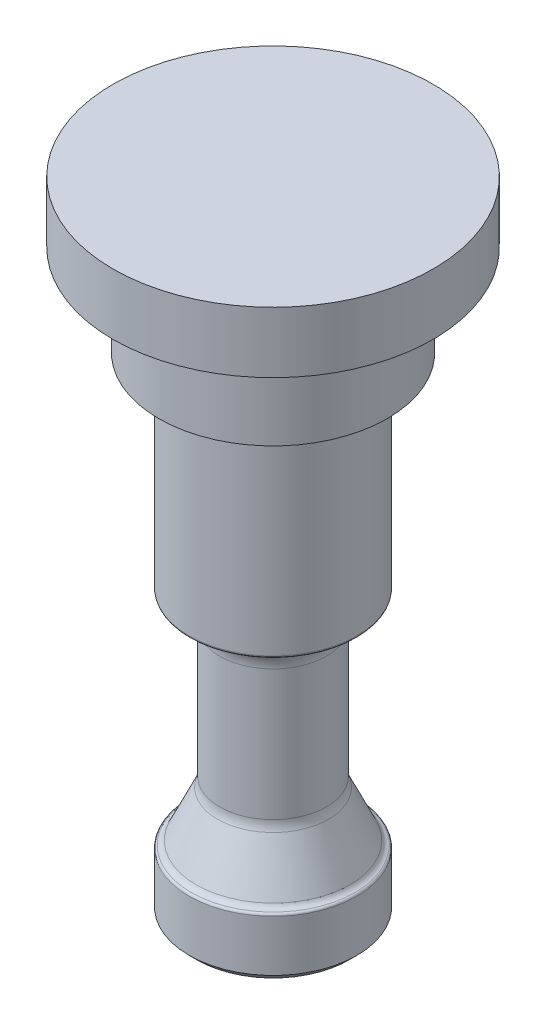
ISO-10303-21;
HEADER;
FILE_DESCRIPTION(('STEP AP214'),'2;1');
FILE_NAME('part.step','',(''),(''),'','','');
FILE_SCHEMA(('AUTOMOTIVE_DESIGN { 1 0 10303 214 1 1 1 1 }'));
ENDSEC;
DATA;
#1=APPLICATION_CONTEXT('core data for automotive mechanical design processes');
#2=APPLICATION_PROTOCOL_DEFINITION('international standard','automotive_design',2000,#1);
#3=PRODUCT_CONTEXT('',#1,'mechanical');
#4=PRODUCT('Part','Part','',(#3));
#5=PRODUCT_RELATED_PRODUCT_CATEGORY('part','',(#4));
#6=PRODUCT_DEFINITION_FORMATION('','',#4);
#7=PRODUCT_DEFINITION_CONTEXT('part definition',#1,'design');
#8=PRODUCT_DEFINITION('design','',#6,#7);
#9=PRODUCT_DEFINITION_SHAPE('','',#8);
#10=(LENGTH_UNIT() NAMED_UNIT(*) SI_UNIT(.MILLI.,.METRE.));
#11=(NAMED_UNIT(*) PLANE_ANGLE_UNIT() SI_UNIT($,.RADIAN.));
#12=(NAMED_UNIT(*) SI_UNIT($,.STERADIAN.) SOLID_ANGLE_UNIT());
#13=UNCERTAINTY_MEASURE_WITH_UNIT(LENGTH_MEASURE(1.E-05),#10,'distance_accuracy_value','');
#14=(GEOMETRIC_REPRESENTATION_CONTEXT(3) GLOBAL_UNCERTAINTY_ASSIGNED_CONTEXT((#13)) GLOBAL_UNIT_ASSIGNED_CONTEXT((#10,
#11,#12)) REPRESENTATION_CONTEXT('',''));
#15=CARTESIAN_POINT('',(0.,0.,0.));
#16=DIRECTION('',(0.,0.,1.));
#17=DIRECTION('',(1.,0.,0.));
#18=AXIS2_PLACEMENT_3D('',#15,#16,#17);
#19=CARTESIAN_POINT('',(0.,50.8,0.));
#20=DIRECTION('',(0.,-1.,0.));
#21=DIRECTION('',(0.,0.,-1.));
#22=AXIS2_PLACEMENT_3D('',#19,#20,#21);
#23=CYLINDRICAL_SURFACE('',#22,8.73125);
#24=CARTESIAN_POINT('',(0.,6.12725402730753,0.));
#25=DIRECTION('',(0.,-1.,0.));
#26=DIRECTION('',(0.,0.,-1.));
#27=AXIS2_PLACEMENT_3D('',#24,#25,#26);
#28=CIRCLE('',#27,8.73125);
#29=CARTESIAN_POINT('',(0.,6.12725402730753,-8.73125));
#30=VERTEX_POINT('',#29);
#31=EDGE_CURVE('E46',#30,#30,#28,.T.);
#32=ORIENTED_EDGE('',*,*,#31,.T.);
#33=EDGE_LOOP('',(#32));
#34=FACE_BOUND('',#33,.T.);
#35=CARTESIAN_POINT('',(0.,0.79375000000001,0.));
#36=DIRECTION('',(0.,1.,0.));
#37=DIRECTION('',(0.,0.,1.));
#38=AXIS2_PLACEMENT_3D('',#35,#36,#37);
#39=CIRCLE('',#38,8.73125);
#40=CARTESIAN_POINT('',(0.,0.79375000000001,8.73125));
#41=VERTEX_POINT('',#40);
#42=EDGE_CURVE('E70',#41,#41,#39,.T.);
#43=ORIENTED_EDGE('',*,*,#42,.T.);
#44=EDGE_LOOP('',(#43));
#45=FACE_BOUND('',#44,.T.);
#46=ADVANCED_FACE('F35',(#34,#45),#23,.T.);
#47=CARTESIAN_POINT('',(0.,0.,0.));
#48=DIRECTION('',(0.,1.,0.));
#49=DIRECTION('',(0.,0.,1.));
#50=AXIS2_PLACEMENT_3D('',#47,#48,#49);
#51=PLANE('',#50);
#52=CARTESIAN_POINT('',(0.,0.,0.));
#53=DIRECTION('',(0.,-1.,0.));
#54=DIRECTION('',(0.,0.,-1.));
#55=AXIS2_PLACEMENT_3D('',#52,#53,#54);
#56=CIRCLE('',#55,2.38125);
#57=CARTESIAN_POINT('',(0.,0.,-2.38125));
#58=VERTEX_POINT('',#57);
#59=EDGE_CURVE('E95',#58,#58,#56,.T.);
#60=ORIENTED_EDGE('',*,*,#59,.F.);
#61=EDGE_LOOP('',(#60));
#62=FACE_BOUND('',#61,.T.);
#63=CARTESIAN_POINT('',(0.,0.,0.));
#64=DIRECTION('',(0.,1.,0.));
#65=DIRECTION('',(0.,0.,1.));
#66=AXIS2_PLACEMENT_3D('',#63,#64,#65);
#67=CIRCLE('',#66,7.93749999999999);
#68=CARTESIAN_POINT('',(0.,0.,7.93749999999999));
#69=VERTEX_POINT('',#68);
#70=EDGE_CURVE('E67',#69,#69,#67,.F.);
#71=ORIENTED_EDGE('',*,*,#70,.T.);
#72=EDGE_LOOP('',(#71));
#73=FACE_BOUND('',#72,.T.);
#74=ADVANCED_FACE('F109',(#62,#73),#51,.F.);
#75=CARTESIAN_POINT('',(0.,0.79375000000001,0.));
#76=DIRECTION('',(0.,1.,0.));
#77=DIRECTION('',(0.,0.,1.));
#78=AXIS2_PLACEMENT_3D('',#75,#76,#77);
#79=CONICAL_SURFACE('',#78,8.73125,0.785398163397446);
#80=ORIENTED_EDGE('',*,*,#70,.F.);
#81=EDGE_LOOP('',(#80));
#82=FACE_BOUND('',#81,.T.);
#83=ORIENTED_EDGE('',*,*,#42,.F.);
#84=EDGE_LOOP('',(#83));
#85=FACE_BOUND('',#84,.T.);
#86=ADVANCED_FACE('F112',(#82,#85),#79,.T.);
#87=CARTESIAN_POINT('',(0.,12.602297381409,0.));
#88=DIRECTION('',(0.,1.,0.));
#89=DIRECTION('',(0.,0.,1.));
#90=AXIS2_PLACEMENT_3D('',#87,#88,#89);
#91=TOROIDAL_SURFACE('',#90,7.93749999999999,2.38125);
#92=CARTESIAN_POINT('',(0.,11.595937645639,0.));
#93=DIRECTION('',(0.,1.,0.));
#94=DIRECTION('',(0.,0.,1.));
#95=AXIS2_PLACEMENT_3D('',#92,#93,#94);
#96=CIRCLE('',#95,5.77935458211897);
#97=CARTESIAN_POINT('',(0.,11.595937645639,5.77935458211897));
#98=VERTEX_POINT('',#97);
#99=EDGE_CURVE('E73',#98,#98,#96,.T.);
#100=ORIENTED_EDGE('',*,*,#99,.T.);
#101=EDGE_LOOP('',(#100));
#102=FACE_BOUND('',#101,.T.);
#103=CARTESIAN_POINT('',(0.,12.602297381409,0.));
#104=DIRECTION('',(0.,1.,0.));
#105=DIRECTION('',(0.,0.,1.));
#106=AXIS2_PLACEMENT_3D('',#103,#104,#105);
#107=CIRCLE('',#106,5.55624999999999);
#108=CARTESIAN_POINT('',(0.,12.602297381409,5.55624999999999));
#109=VERTEX_POINT('',#108);
#110=EDGE_CURVE('E82',#109,#109,#107,.T.);
#111=ORIENTED_EDGE('',*,*,#110,.F.);
#112=EDGE_LOOP('',(#111));
#113=FACE_BOUND('',#112,.T.);
#114=ADVANCED_FACE('F118',(#102,#113),#91,.F.);
#115=CARTESIAN_POINT('',(0.,11.595937645639,0.));
#116=DIRECTION('',(0.,-1.,0.));
#117=DIRECTION('',(0.,0.,-1.));
#118=AXIS2_PLACEMENT_3D('',#115,#116,#117);
#119=CONICAL_SURFACE('',#118,5.77935458211897,0.436332312998583);
#120=CARTESIAN_POINT('',(0.,6.80829675474332,0.));
#121=DIRECTION('',(0.,1.,0.));
#122=DIRECTION('',(0.,0.,1.));
#123=AXIS2_PLACEMENT_3D('',#120,#121,#122);
#124=CIRCLE('',#123,8.01186819403965);
#125=CARTESIAN_POINT('',(0.,6.80829675474332,8.01186819403965));
#126=VERTEX_POINT('',#125);
#127=EDGE_CURVE('E76',#126,#126,#124,.T.);
#128=ORIENTED_EDGE('',*,*,#127,.T.);
#129=EDGE_LOOP('',(#128));
#130=FACE_BOUND('',#129,.T.);
#131=ORIENTED_EDGE('',*,*,#99,.F.);
#132=EDGE_LOOP('',(#131));
#133=FACE_BOUND('',#132,.T.);
#134=ADVANCED_FACE('F174',(#130,#133),#119,.T.);
#135=CARTESIAN_POINT('',(0.,7.14375,0.));
#136=DIRECTION('',(0.,1.,0.));
#137=DIRECTION('',(0.,0.,1.));
#138=AXIS2_PLACEMENT_3D('',#135,#136,#137);
#139=TOROIDAL_SURFACE('',#138,8.73124999999999,0.793750000000001);
#140=CARTESIAN_POINT('',(0.,6.37367729341487,0.));
#141=DIRECTION('',(0.,1.,0.));
#142=DIRECTION('',(0.,0.,1.));
#143=AXIS2_PLACEMENT_3D('',#140,#141,#142);
#144=CIRCLE('',#143,8.53882575757577);
#145=CARTESIAN_POINT('',(0.,6.37367729341487,8.53882575757577));
#146=VERTEX_POINT('',#145);
#147=EDGE_CURVE('E50',#146,#146,#144,.T.);
#148=ORIENTED_EDGE('',*,*,#147,.T.);
#149=EDGE_LOOP('',(#148));
#150=FACE_BOUND('',#149,.T.);
#151=ORIENTED_EDGE('',*,*,#127,.F.);
#152=EDGE_LOOP('',(#151));
#153=FACE_BOUND('',#152,.T.);
#154=ADVANCED_FACE('F170',(#150,#153),#139,.F.);
#155=CARTESIAN_POINT('',(0.,26.19375,0.));
#156=DIRECTION('',(0.,1.,0.));
#157=DIRECTION('',(0.,0.,1.));
#158=AXIS2_PLACEMENT_3D('',#155,#156,#157);
#159=TOROIDAL_SURFACE('',#158,8.73125,3.175);
#160=CARTESIAN_POINT('',(0.,29.3600274560473,0.));
#161=DIRECTION('',(0.,-1.,0.));
#162=DIRECTION('',(0.,0.,-1.));
#163=AXIS2_PLACEMENT_3D('',#160,#161,#162);
#164=CIRCLE('',#163,8.49606481481477);
#165=CARTESIAN_POINT('',(0.,29.3600274560473,-8.49606481481477));
#166=VERTEX_POINT('',#165);
#167=EDGE_CURVE('E58',#166,#166,#164,.T.);
#168=ORIENTED_EDGE('',*,*,#167,.T.);
#169=EDGE_LOOP('',(#168));
#170=FACE_BOUND('',#169,.T.);
#171=CARTESIAN_POINT('',(0.,26.19375,0.));
#172=DIRECTION('',(0.,1.,0.));
#173=DIRECTION('',(0.,0.,1.));
#174=AXIS2_PLACEMENT_3D('',#171,#172,#173);
#175=CIRCLE('',#174,5.55625);
#176=CARTESIAN_POINT('',(0.,26.19375,5.55625));
#177=VERTEX_POINT('',#176);
#178=EDGE_CURVE('E79',#177,#177,#175,.T.);
#179=ORIENTED_EDGE('',*,*,#178,.T.);
#180=EDGE_LOOP('',(#179));
#181=FACE_BOUND('',#180,.T.);
#182=ADVANCED_FACE('F139',(#170,#181),#159,.F.);
#183=CARTESIAN_POINT('',(0.,50.8,0.));
#184=DIRECTION('',(0.,1.,0.));
#185=DIRECTION('',(0.,0.,1.));
#186=AXIS2_PLACEMENT_3D('',#183,#184,#185);
#187=CYLINDRICAL_SURFACE('',#186,5.55625);
#188=ORIENTED_EDGE('',*,*,#178,.F.);
#189=EDGE_LOOP('',(#188));
#190=FACE_BOUND('',#189,.T.);
#191=ORIENTED_EDGE('',*,*,#110,.T.);
#192=EDGE_LOOP('',(#191));
#193=FACE_BOUND('',#192,.T.);
#194=ADVANCED_FACE('F130',(#190,#193),#187,.T.);
#195=CARTESIAN_POINT('',(0.,29.6133296525304,0.));
#196=DIRECTION('',(0.,-1.,0.));
#197=DIRECTION('',(0.,0.,-1.));
#198=AXIS2_PLACEMENT_3D('',#195,#196,#197);
#199=CIRCLE('',#198,8.73125);
#200=CARTESIAN_POINT('',(0.,29.6133296525304,-8.73125));
#201=VERTEX_POINT('',#200);
#202=EDGE_CURVE('E61',#201,#201,#199,.F.);
#203=ORIENTED_EDGE('',*,*,#202,.T.);
#204=EDGE_LOOP('',(#203));
#205=FACE_BOUND('',#204,.T.);
#206=CARTESIAN_POINT('',(0.,50.546,0.));
#207=DIRECTION('',(0.,1.,0.));
#208=DIRECTION('',(0.,0.,1.));
#209=AXIS2_PLACEMENT_3D('',#206,#207,#208);
#210=CIRCLE('',#209,8.73125);
#211=CARTESIAN_POINT('',(0.,50.546,8.73125));
#212=VERTEX_POINT('',#211);
#213=EDGE_CURVE('E64',#212,#212,#210,.F.);
#214=ORIENTED_EDGE('',*,*,#213,.T.);
#215=EDGE_LOOP('',(#214));
#216=FACE_BOUND('',#215,.T.);
#217=ADVANCED_FACE('F125',(#205,#216),#23,.T.);
#218=CARTESIAN_POINT('',(0.,29.6133296525304,0.));
#219=DIRECTION('',(0.,-1.,0.));
#220=DIRECTION('',(0.,0.,-1.));
#221=AXIS2_PLACEMENT_3D('',#218,#219,#220);
#222=TOROIDAL_SURFACE('',#221,8.47725,0.254);
#223=ORIENTED_EDGE('',*,*,#167,.F.);
#224=EDGE_LOOP('',(#223));
#225=FACE_BOUND('',#224,.T.);
#226=ORIENTED_EDGE('',*,*,#202,.F.);
#227=EDGE_LOOP('',(#226));
#228=FACE_BOUND('',#227,.T.);
#229=ADVANCED_FACE('F129',(#225,#228),#222,.T.);
#230=CARTESIAN_POINT('',(0.,50.546,0.));
#231=DIRECTION('',(0.,1.,0.));
#232=DIRECTION('',(0.,0.,1.));
#233=AXIS2_PLACEMENT_3D('',#230,#231,#232);
#234=TOROIDAL_SURFACE('',#233,8.47725,0.254);
#235=ORIENTED_EDGE('',*,*,#213,.F.);
#236=EDGE_LOOP('',(#235));
#237=FACE_BOUND('',#236,.T.);
#238=CARTESIAN_POINT('',(0.,50.8,0.));
#239=DIRECTION('',(0.,1.,0.));
#240=DIRECTION('',(0.,0.,1.));
#241=AXIS2_PLACEMENT_3D('',#238,#239,#240);
#242=CIRCLE('',#241,8.47725);
#243=CARTESIAN_POINT('',(0.,50.8,8.47725));
#244=VERTEX_POINT('',#243);
#245=EDGE_CURVE('E55',#244,#244,#242,.T.);
#246=ORIENTED_EDGE('',*,*,#245,.F.);
#247=EDGE_LOOP('',(#246));
#248=FACE_BOUND('',#247,.T.);
#249=ADVANCED_FACE('F136',(#237,#248),#234,.T.);
#250=CARTESIAN_POINT('',(0.,6.12725402730753,0.));
#251=DIRECTION('',(0.,-1.,0.));
#252=DIRECTION('',(0.,0.,-1.));
#253=AXIS2_PLACEMENT_3D('',#250,#251,#252);
#254=TOROIDAL_SURFACE('',#253,8.47725,0.254);
#255=ORIENTED_EDGE('',*,*,#31,.F.);
#256=EDGE_LOOP('',(#255));
#257=FACE_BOUND('',#256,.T.);
#258=ORIENTED_EDGE('',*,*,#147,.F.);
#259=EDGE_LOOP('',(#258));
#260=FACE_BOUND('',#259,.T.);
#261=ADVANCED_FACE('F148',(#257,#260),#254,.T.);
#262=CARTESIAN_POINT('',(0.,60.325,0.));
#263=DIRECTION('',(0.,-1.,0.));
#264=DIRECTION('',(0.,0.,-1.));
#265=AXIS2_PLACEMENT_3D('',#262,#263,#264);
#266=CYLINDRICAL_SURFACE('',#265,11.90625);
#267=CARTESIAN_POINT('',(0.,59.055,0.));
#268=DIRECTION('',(0.,1.,0.));
#269=DIRECTION('',(0.,0.,1.));
#270=AXIS2_PLACEMENT_3D('',#267,#268,#269);
#271=CIRCLE('',#270,11.90625);
#272=CARTESIAN_POINT('',(0.,59.055,-11.90625));
#273=VERTEX_POINT('',#272);
#274=EDGE_CURVE('E10',#273,#273,#271,.F.);
#275=CARTESIAN_POINT('',(0.,50.8,0.));
#276=DIRECTION('',(0.,1.,0.));
#277=DIRECTION('',(0.,0.,1.));
#278=AXIS2_PLACEMENT_3D('',#275,#276,#277);
#279=CIRCLE('',#278,11.90625);
#280=CARTESIAN_POINT('',(0.,50.8,-11.90625));
#281=VERTEX_POINT('',#280);
#282=EDGE_CURVE('E85',#281,#281,#279,.T.);
#283=CARTESIAN_POINT('',(0.,59.055,-11.90625));
#284=CARTESIAN_POINT('',(0.,58.9690104166667,-11.90625));
#285=CARTESIAN_POINT('',(0.,58.8830208333333,-11.90625));
#286=CARTESIAN_POINT('',(0.,58.7110416666667,-11.90625));
#287=CARTESIAN_POINT('',(0.,58.6250520833333,-11.90625));
#288=CARTESIAN_POINT('',(0.,58.4530729166667,-11.90625));
#289=CARTESIAN_POINT('',(0.,58.3670833333333,-11.90625));
#290=CARTESIAN_POINT('',(0.,58.1951041666667,-11.90625));
#291=CARTESIAN_POINT('',(0.,58.1091145833333,-11.90625));
#292=CARTESIAN_POINT('',(0.,57.9371354166667,-11.90625));
#293=CARTESIAN_POINT('',(0.,57.8511458333333,-11.90625));
#294=CARTESIAN_POINT('',(0.,57.6791666666667,-11.90625));
#295=CARTESIAN_POINT('',(0.,57.5931770833333,-11.90625));
#296=CARTESIAN_POINT('',(0.,57.4211979166667,-11.90625));
#297=CARTESIAN_POINT('',(0.,57.3352083333333,-11.90625));
#298=CARTESIAN_POINT('',(0.,57.1632291666667,-11.90625));
#299=CARTESIAN_POINT('',(0.,57.0772395833333,-11.90625));
#300=CARTESIAN_POINT('',(0.,56.9052604166667,-11.90625));
#301=CARTESIAN_POINT('',(0.,56.8192708333333,-11.90625));
#302=CARTESIAN_POINT('',(0.,56.6472916666667,-11.90625));
#303=CARTESIAN_POINT('',(0.,56.5613020833333,-11.90625));
#304=CARTESIAN_POINT('',(0.,56.3893229166667,-11.90625));
#305=CARTESIAN_POINT('',(0.,56.3033333333333,-11.90625));
#306=CARTESIAN_POINT('',(0.,56.1313541666667,-11.90625));
#307=CARTESIAN_POINT('',(0.,56.0453645833333,-11.90625));
#308=CARTESIAN_POINT('',(0.,55.8733854166667,-11.90625));
#309=CARTESIAN_POINT('',(0.,55.7873958333333,-11.90625));
#310=CARTESIAN_POINT('',(0.,55.6154166666667,-11.90625));
#311=CARTESIAN_POINT('',(0.,55.5294270833333,-11.90625));
#312=CARTESIAN_POINT('',(0.,55.3574479166667,-11.90625));
#313=CARTESIAN_POINT('',(0.,55.2714583333333,-11.90625));
#314=CARTESIAN_POINT('',(0.,55.0994791666667,-11.90625));
#315=CARTESIAN_POINT('',(0.,55.0134895833333,-11.90625));
#316=CARTESIAN_POINT('',(0.,54.8415104166667,-11.90625));
#317=CARTESIAN_POINT('',(0.,54.7555208333333,-11.90625));
#318=CARTESIAN_POINT('',(0.,54.5835416666667,-11.90625));
#319=CARTESIAN_POINT('',(0.,54.4975520833333,-11.90625));
#320=CARTESIAN_POINT('',(0.,54.3255729166667,-11.90625));
#321=CARTESIAN_POINT('',(0.,54.2395833333333,-11.90625));
#322=CARTESIAN_POINT('',(0.,54.0676041666667,-11.90625));
#323=CARTESIAN_POINT('',(0.,53.9816145833333,-11.90625));
#324=CARTESIAN_POINT('',(0.,53.8096354166667,-11.90625));
#325=CARTESIAN_POINT('',(0.,53.7236458333333,-11.90625));
#326=CARTESIAN_POINT('',(0.,53.5516666666667,-11.90625));
#327=CARTESIAN_POINT('',(0.,53.4656770833333,-11.90625));
#328=CARTESIAN_POINT('',(0.,53.2936979166667,-11.90625));
#329=CARTESIAN_POINT('',(0.,53.2077083333333,-11.90625));
#330=CARTESIAN_POINT('',(0.,53.0357291666667,-11.90625));
#331=CARTESIAN_POINT('',(0.,52.9497395833333,-11.90625));
#332=CARTESIAN_POINT('',(0.,52.7777604166667,-11.90625));
#333=CARTESIAN_POINT('',(0.,52.6917708333333,-11.90625));
#334=CARTESIAN_POINT('',(0.,52.5197916666667,-11.90625));
#335=CARTESIAN_POINT('',(0.,52.4338020833333,-11.90625));
#336=CARTESIAN_POINT('',(0.,52.2618229166667,-11.90625));
#337=CARTESIAN_POINT('',(0.,52.1758333333333,-11.90625));
#338=CARTESIAN_POINT('',(0.,52.0038541666667,-11.90625));
#339=CARTESIAN_POINT('',(0.,51.9178645833333,-11.90625));
#340=CARTESIAN_POINT('',(0.,51.7458854166667,-11.90625));
#341=CARTESIAN_POINT('',(0.,51.6598958333333,-11.90625));
#342=CARTESIAN_POINT('',(0.,51.4879166666667,-11.90625));
#343=CARTESIAN_POINT('',(0.,51.4019270833333,-11.90625));
#344=CARTESIAN_POINT('',(0.,51.2299479166667,-11.90625));
#345=CARTESIAN_POINT('',(0.,51.1439583333333,-11.90625));
#346=CARTESIAN_POINT('',(0.,50.9719791666667,-11.90625));
#347=CARTESIAN_POINT('',(0.,50.8859895833333,-11.90625));
#348=CARTESIAN_POINT('',(0.,50.8,-11.90625));
#349=B_SPLINE_CURVE_WITH_KNOTS('',3,(#283,#284,#285,#286,#287,#288,#289,#290,#291,#292,#293,
#294,#295,#296,#297,#298,#299,#300,#301,#302,#303,#304,#305,#306,#307,#308,#309,#310,#311,#312,
#313,#314,#315,#316,#317,#318,#319,#320,#321,#322,#323,#324,#325,#326,#327,#328,#329,#330,#331,
#332,#333,#334,#335,#336,#337,#338,#339,#340,#341,#342,#343,#344,#345,#346,#347,#348),
.UNSPECIFIED.,.F.,.F.,(4,2,2,2,2,2,2,2,2,2,2,2,2,2,2,2,2,2,2,2,2,2,2,2,2,2,2,2,2,2,2,2,4),(0.,
0.257968749999997,0.515937499999994,0.773906249999998,1.03187499999999,1.28984375,1.5478125,
1.80578125,2.06375,2.32171875,2.5796875,2.83765624999999,3.095625,3.35359374999999,3.6115625,
3.86953125,4.1275,4.38546875,4.6434375,4.90140625,5.15937499999999,5.41734375,5.67531249999999,
5.93328125,6.19125,6.44921875,6.7071875,6.96515625,7.223125,7.48109374999999,7.7390625,
7.99703124999999,8.255),.UNSPECIFIED.);
#350=EDGE_CURVE('BSEAM156',#273,#281,#349,.T.);
#351=ORIENTED_EDGE('',*,*,#274,.T.);
#352=ORIENTED_EDGE('',*,*,#282,.T.);
#353=ORIENTED_EDGE('',*,*,#350,.T.);
#354=ORIENTED_EDGE('',*,*,#350,.F.);
#355=EDGE_LOOP('',(#351,#353,#352,#354));
#356=FACE_BOUND('',#355,.T.);
#357=ADVANCED_FACE('F156',(#356),#266,.T.);
#358=CARTESIAN_POINT('',(0.,50.8,0.));
#359=DIRECTION('',(0.,1.,0.));
#360=DIRECTION('',(0.,0.,1.));
#361=AXIS2_PLACEMENT_3D('',#358,#359,#360);
#362=PLANE('',#361);
#363=ORIENTED_EDGE('',*,*,#245,.T.);
#364=EDGE_LOOP('',(#363));
#365=FACE_BOUND('',#364,.T.);
#366=ORIENTED_EDGE('',*,*,#282,.F.);
#367=EDGE_LOOP('',(#366));
#368=FACE_BOUND('',#367,.T.);
#369=ADVANCED_FACE('F152',(#365,#368),#362,.F.);
#370=CARTESIAN_POINT('',(0.,66.675,0.));
#371=DIRECTION('',(0.,-1.,0.));
#372=DIRECTION('',(0.,0.,-1.));
#373=AXIS2_PLACEMENT_3D('',#370,#371,#372);
#374=CYLINDRICAL_SURFACE('',#373,16.66875);
#375=CARTESIAN_POINT('',(0.,66.675,0.));
#376=DIRECTION('',(0.,1.,0.));
#377=DIRECTION('',(0.,0.,1.));
#378=AXIS2_PLACEMENT_3D('',#375,#376,#377);
#379=CIRCLE('',#378,16.66875);
#380=CARTESIAN_POINT('',(0.,66.675,16.66875));
#381=VERTEX_POINT('',#380);
#382=EDGE_CURVE('E88',#381,#381,#379,.T.);
#383=ORIENTED_EDGE('',*,*,#382,.F.);
#384=EDGE_LOOP('',(#383));
#385=FACE_BOUND('',#384,.T.);
#386=CARTESIAN_POINT('',(0.,60.325,0.));
#387=DIRECTION('',(0.,1.,0.));
#388=DIRECTION('',(0.,0.,1.));
#389=AXIS2_PLACEMENT_3D('',#386,#387,#388);
#390=CIRCLE('',#389,16.66875);
#391=CARTESIAN_POINT('',(0.,60.325,16.66875));
#392=VERTEX_POINT('',#391);
#393=EDGE_CURVE('E89',#392,#392,#390,.T.);
#394=ORIENTED_EDGE('',*,*,#393,.T.);
#395=EDGE_LOOP('',(#394));
#396=FACE_BOUND('',#395,.T.);
#397=ADVANCED_FACE('F155',(#385,#396),#374,.T.);
#398=CARTESIAN_POINT('',(0.,66.675,0.));
#399=DIRECTION('',(0.,1.,0.));
#400=DIRECTION('',(0.,0.,1.));
#401=AXIS2_PLACEMENT_3D('',#398,#399,#400);
#402=PLANE('',#401);
#403=ORIENTED_EDGE('',*,*,#382,.T.);
#404=EDGE_LOOP('',(#403));
#405=FACE_BOUND('',#404,.T.);
#406=ADVANCED_FACE('F267',(#405),#402,.T.);
#407=CARTESIAN_POINT('',(0.,60.325,0.));
#408=DIRECTION('',(0.,1.,0.));
#409=DIRECTION('',(0.,0.,1.));
#410=AXIS2_PLACEMENT_3D('',#407,#408,#409);
#411=PLANE('',#410);
#412=CARTESIAN_POINT('',(0.,60.325,0.));
#413=DIRECTION('',(0.,1.,0.));
#414=DIRECTION('',(0.,0.,1.));
#415=AXIS2_PLACEMENT_3D('',#412,#413,#414);
#416=CIRCLE('',#415,13.17625);
#417=CARTESIAN_POINT('',(0.,60.325,13.17625));
#418=VERTEX_POINT('',#417);
#419=EDGE_CURVE('E42',#418,#418,#416,.T.);
#420=ORIENTED_EDGE('',*,*,#419,.T.);
#421=EDGE_LOOP('',(#420));
#422=FACE_BOUND('',#421,.T.);
#423=ORIENTED_EDGE('',*,*,#393,.F.);
#424=EDGE_LOOP('',(#423));
#425=FACE_BOUND('',#424,.T.);
#426=ADVANCED_FACE('F275',(#422,#425),#411,.F.);
#427=CARTESIAN_POINT('',(0.,59.055,0.));
#428=DIRECTION('',(0.,1.,0.));
#429=DIRECTION('',(0.,0.,1.));
#430=AXIS2_PLACEMENT_3D('',#427,#428,#429);
#431=TOROIDAL_SURFACE('',#430,13.17625,1.27);
#432=ORIENTED_EDGE('',*,*,#274,.F.);
#433=EDGE_LOOP('',(#432));
#434=FACE_BOUND('',#433,.T.);
#435=ORIENTED_EDGE('',*,*,#419,.F.);
#436=EDGE_LOOP('',(#435));
#437=FACE_BOUND('',#436,.T.);
#438=ADVANCED_FACE('F37',(#434,#437),#431,.F.);
#439=CARTESIAN_POINT('',(0.,19.05,0.));
#440=DIRECTION('',(0.,-1.,0.));
#441=DIRECTION('',(0.,0.,-1.));
#442=AXIS2_PLACEMENT_3D('',#439,#440,#441);
#443=CYLINDRICAL_SURFACE('',#442,2.38125);
#444=CARTESIAN_POINT('',(0.,19.05,0.));
#445=DIRECTION('',(0.,-1.,0.));
#446=DIRECTION('',(0.,0.,-1.));
#447=AXIS2_PLACEMENT_3D('',#444,#445,#446);
#448=CIRCLE('',#447,2.38125);
#449=CARTESIAN_POINT('',(0.,19.05,-2.38125));
#450=VERTEX_POINT('',#449);
#451=EDGE_CURVE('E92',#450,#450,#448,.T.);
#452=CARTESIAN_POINT('',(0.,19.05,-2.38125));
#453=CARTESIAN_POINT('',(0.,18.8515625,-2.38125));
#454=CARTESIAN_POINT('',(0.,18.653125,-2.38125));
#455=CARTESIAN_POINT('',(0.,18.25625,-2.38125));
#456=CARTESIAN_POINT('',(0.,18.0578125,-2.38125));
#457=CARTESIAN_POINT('',(0.,17.6609375,-2.38125));
#458=CARTESIAN_POINT('',(0.,17.4625,-2.38125));
#459=CARTESIAN_POINT('',(0.,17.065625,-2.38125));
#460=CARTESIAN_POINT('',(0.,16.8671875,-2.38125));
#461=CARTESIAN_POINT('',(0.,16.4703125,-2.38125));
#462=CARTESIAN_POINT('',(0.,16.271875,-2.38125));
#463=CARTESIAN_POINT('',(0.,15.875,-2.38125));
#464=CARTESIAN_POINT('',(0.,15.6765625,-2.38125));
#465=CARTESIAN_POINT('',(0.,15.2796875,-2.38125));
#466=CARTESIAN_POINT('',(0.,15.08125,-2.38125));
#467=CARTESIAN_POINT('',(0.,14.684375,-2.38125));
#468=CARTESIAN_POINT('',(0.,14.4859375,-2.38125));
#469=CARTESIAN_POINT('',(0.,14.0890625,-2.38125));
#470=CARTESIAN_POINT('',(0.,13.890625,-2.38125));
#471=CARTESIAN_POINT('',(0.,13.49375,-2.38125));
#472=CARTESIAN_POINT('',(0.,13.2953125,-2.38125));
#473=CARTESIAN_POINT('',(0.,12.8984375,-2.38125));
#474=CARTESIAN_POINT('',(0.,12.7,-2.38125));
#475=CARTESIAN_POINT('',(0.,12.303125,-2.38125));
#476=CARTESIAN_POINT('',(0.,12.1046875,-2.38125));
#477=CARTESIAN_POINT('',(0.,11.7078125,-2.38125));
#478=CARTESIAN_POINT('',(0.,11.509375,-2.38125));
#479=CARTESIAN_POINT('',(0.,11.1125,-2.38125));
#480=CARTESIAN_POINT('',(0.,10.9140625,-2.38125));
#481=CARTESIAN_POINT('',(0.,10.5171875,-2.38125));
#482=CARTESIAN_POINT('',(0.,10.31875,-2.38125));
#483=CARTESIAN_POINT('',(0.,9.921875,-2.38125));
#484=CARTESIAN_POINT('',(0.,9.7234375,-2.38125));
#485=CARTESIAN_POINT('',(0.,9.3265625,-2.38125));
#486=CARTESIAN_POINT('',(0.,9.128125,-2.38125));
#487=CARTESIAN_POINT('',(0.,8.73125,-2.38125));
#488=CARTESIAN_POINT('',(0.,8.5328125,-2.38125));
#489=CARTESIAN_POINT('',(0.,8.1359375,-2.38125));
#490=CARTESIAN_POINT('',(0.,7.9375,-2.38125));
#491=CARTESIAN_POINT('',(0.,7.540625,-2.38125));
#492=CARTESIAN_POINT('',(0.,7.3421875,-2.38125));
#493=CARTESIAN_POINT('',(0.,6.9453125,-2.38125));
#494=CARTESIAN_POINT('',(0.,6.746875,-2.38125));
#495=CARTESIAN_POINT('',(0.,6.35,-2.38125));
#496=CARTESIAN_POINT('',(0.,6.1515625,-2.38125));
#497=CARTESIAN_POINT('',(0.,5.7546875,-2.38125));
#498=CARTESIAN_POINT('',(0.,5.55625,-2.38125));
#499=CARTESIAN_POINT('',(0.,5.159375,-2.38125));
#500=CARTESIAN_POINT('',(0.,4.9609375,-2.38125));
#501=CARTESIAN_POINT('',(0.,4.5640625,-2.38125));
#502=CARTESIAN_POINT('',(0.,4.365625,-2.38125));
#503=CARTESIAN_POINT('',(0.,3.96875,-2.38125));
#504=CARTESIAN_POINT('',(0.,3.7703125,-2.38125));
#505=CARTESIAN_POINT('',(0.,3.3734375,-2.38125));
#506=CARTESIAN_POINT('',(0.,3.175,-2.38125));
#507=CARTESIAN_POINT('',(0.,2.778125,-2.38125));
#508=CARTESIAN_POINT('',(0.,2.5796875,-2.38125));
#509=CARTESIAN_POINT('',(0.,2.1828125,-2.38125));
#510=CARTESIAN_POINT('',(0.,1.984375,-2.38125));
#511=CARTESIAN_POINT('',(0.,1.5875,-2.38125));
#512=CARTESIAN_POINT('',(0.,1.3890625,-2.38125));
#513=CARTESIAN_POINT('',(0.,0.992187500000001,-2.38125));
#514=CARTESIAN_POINT('',(0.,0.793750000000001,-2.38125));
#515=CARTESIAN_POINT('',(0.,0.396875,-2.38125));
#516=CARTESIAN_POINT('',(0.,0.1984375,-2.38125));
#517=CARTESIAN_POINT('',(0.,0.,-2.38125));
#518=B_SPLINE_CURVE_WITH_KNOTS('',3,(#452,#453,#454,#455,#456,#457,#458,#459,#460,#461,#462,
#463,#464,#465,#466,#467,#468,#469,#470,#471,#472,#473,#474,#475,#476,#477,#478,#479,#480,#481,
#482,#483,#484,#485,#486,#487,#488,#489,#490,#491,#492,#493,#494,#495,#496,#497,#498,#499,#500,
#501,#502,#503,#504,#505,#506,#507,#508,#509,#510,#511,#512,#513,#514,#515,#516,#517),
.UNSPECIFIED.,.F.,.F.,(4,2,2,2,2,2,2,2,2,2,2,2,2,2,2,2,2,2,2,2,2,2,2,2,2,2,2,2,2,2,2,2,4),(0.,
0.595312499999997,1.190625,1.7859375,2.38125,2.9765625,3.571875,4.1671875,4.7625,5.3578125,
5.953125,6.5484375,7.14375,7.7390625,8.334375,8.9296875,9.525,10.1203125,10.715625,11.3109375,
11.90625,12.5015625,13.096875,13.6921875,14.2875,14.8828125,15.478125,16.0734375,16.66875,
17.2640625,17.859375,18.4546875,19.05),.UNSPECIFIED.);
#519=EDGE_CURVE('BSEAM103',#450,#58,#518,.T.);
#520=ORIENTED_EDGE('',*,*,#451,.F.);
#521=ORIENTED_EDGE('',*,*,#59,.T.);
#522=ORIENTED_EDGE('',*,*,#519,.T.);
#523=ORIENTED_EDGE('',*,*,#519,.F.);
#524=EDGE_LOOP('',(#520,#522,#521,#523));
#525=FACE_BOUND('',#524,.T.);
#526=ADVANCED_FACE('F103',(#525),#443,.F.);
#527=CARTESIAN_POINT('',(0.,19.05,0.));
#528=DIRECTION('',(0.,-1.,0.));
#529=DIRECTION('',(0.,0.,-1.));
#530=AXIS2_PLACEMENT_3D('',#527,#528,#529);
#531=PLANE('',#530);
#532=ORIENTED_EDGE('',*,*,#451,.T.);
#533=EDGE_LOOP('',(#532));
#534=FACE_BOUND('',#533,.T.);
#535=ADVANCED_FACE('F101',(#534),#531,.T.);
#536=CLOSED_SHELL('',(#46,#74,#86,#114,#134,#154,#182,#194,#217,#229,#249,#261,#357,#369,#397,
#406,#426,#438,#526,#535));
#537=MANIFOLD_SOLID_BREP('B2',#536);
#538=ADVANCED_BREP_SHAPE_REPRESENTATION('',(#18,#537),#14);
#539=SHAPE_DEFINITION_REPRESENTATION(#9,#538);
ENDSEC;
END-ISO-10303-21;
